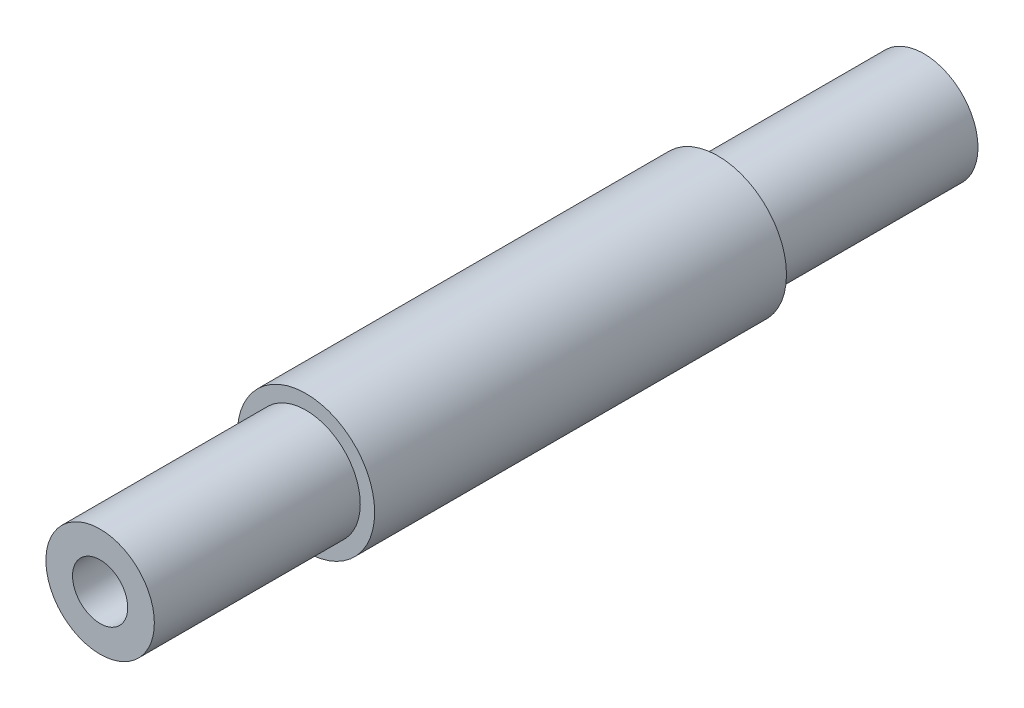
ISO-10303-21;
HEADER;
FILE_DESCRIPTION(('STEP AP214'),'2;1');
FILE_NAME('part.step','',(''),(''),'','','');
FILE_SCHEMA(('AUTOMOTIVE_DESIGN { 1 0 10303 214 1 1 1 1 }'));
ENDSEC;
DATA;
#1=APPLICATION_CONTEXT('core data for automotive mechanical design processes');
#2=APPLICATION_PROTOCOL_DEFINITION('international standard','automotive_design',2000,#1);
#3=PRODUCT_CONTEXT('',#1,'mechanical');
#4=PRODUCT('Part','Part','',(#3));
#5=PRODUCT_RELATED_PRODUCT_CATEGORY('part','',(#4));
#6=PRODUCT_DEFINITION_FORMATION('','',#4);
#7=PRODUCT_DEFINITION_CONTEXT('part definition',#1,'design');
#8=PRODUCT_DEFINITION('design','',#6,#7);
#9=PRODUCT_DEFINITION_SHAPE('','',#8);
#10=(LENGTH_UNIT() NAMED_UNIT(*) SI_UNIT(.MILLI.,.METRE.));
#11=(NAMED_UNIT(*) PLANE_ANGLE_UNIT() SI_UNIT($,.RADIAN.));
#12=(NAMED_UNIT(*) SI_UNIT($,.STERADIAN.) SOLID_ANGLE_UNIT());
#13=UNCERTAINTY_MEASURE_WITH_UNIT(LENGTH_MEASURE(1.E-05),#10,'distance_accuracy_value','');
#14=(GEOMETRIC_REPRESENTATION_CONTEXT(3) GLOBAL_UNCERTAINTY_ASSIGNED_CONTEXT((#13)) GLOBAL_UNIT_ASSIGNED_CONTEXT((#10,
#11,#12)) REPRESENTATION_CONTEXT('',''));
#15=CARTESIAN_POINT('',(0.,0.,0.));
#16=DIRECTION('',(0.,0.,1.));
#17=DIRECTION('',(1.,0.,0.));
#18=AXIS2_PLACEMENT_3D('',#15,#16,#17);
#19=CARTESIAN_POINT('',(0.,0.,19.05));
#20=DIRECTION('',(0.,0.,1.));
#21=DIRECTION('',(1.,0.,0.));
#22=AXIS2_PLACEMENT_3D('',#19,#20,#21);
#23=PLANE('',#22);
#24=CARTESIAN_POINT('',(0.,0.,19.05));
#25=DIRECTION('',(0.,0.,1.));
#26=DIRECTION('',(1.,0.,0.));
#27=AXIS2_PLACEMENT_3D('',#24,#25,#26);
#28=CIRCLE('',#27,6.35);
#29=CARTESIAN_POINT('',(6.35,0.,19.05));
#30=VERTEX_POINT('',#29);
#31=EDGE_CURVE('E11',#30,#30,#28,.T.);
#32=ORIENTED_EDGE('',*,*,#31,.T.);
#33=EDGE_LOOP('',(#32));
#34=FACE_BOUND('',#33,.T.);
#35=CARTESIAN_POINT('',(0.,0.,19.05));
#36=DIRECTION('',(0.,0.,1.));
#37=DIRECTION('',(1.,0.,0.));
#38=AXIS2_PLACEMENT_3D('',#35,#36,#37);
#39=CIRCLE('',#38,5.0165);
#40=CARTESIAN_POINT('',(5.0165,0.,19.05));
#41=VERTEX_POINT('',#40);
#42=EDGE_CURVE('E66',#41,#41,#39,.T.);
#43=ORIENTED_EDGE('',*,*,#42,.F.);
#44=EDGE_LOOP('',(#43));
#45=FACE_BOUND('',#44,.T.);
#46=ADVANCED_FACE('F53',(#34,#45),#23,.T.);
#47=CARTESIAN_POINT('',(0.,0.,-19.05));
#48=DIRECTION('',(0.,0.,1.));
#49=DIRECTION('',(1.,0.,0.));
#50=AXIS2_PLACEMENT_3D('',#47,#48,#49);
#51=PLANE('',#50);
#52=CARTESIAN_POINT('',(0.,0.,-19.05));
#53=DIRECTION('',(0.,0.,1.));
#54=DIRECTION('',(1.,0.,0.));
#55=AXIS2_PLACEMENT_3D('',#52,#53,#54);
#56=CIRCLE('',#55,6.35);
#57=CARTESIAN_POINT('',(6.35,0.,-19.05));
#58=VERTEX_POINT('',#57);
#59=EDGE_CURVE('E57',#58,#58,#56,.T.);
#60=ORIENTED_EDGE('',*,*,#59,.F.);
#61=EDGE_LOOP('',(#60));
#62=FACE_BOUND('',#61,.T.);
#63=CARTESIAN_POINT('',(0.,0.,-19.05));
#64=DIRECTION('',(0.,0.,1.));
#65=DIRECTION('',(1.,0.,0.));
#66=AXIS2_PLACEMENT_3D('',#63,#64,#65);
#67=CIRCLE('',#66,5.0165);
#68=CARTESIAN_POINT('',(5.0165,0.,-19.05));
#69=VERTEX_POINT('',#68);
#70=EDGE_CURVE('E71',#69,#69,#67,.F.);
#71=ORIENTED_EDGE('',*,*,#70,.F.);
#72=EDGE_LOOP('',(#71));
#73=FACE_BOUND('',#72,.T.);
#74=ADVANCED_FACE('F107',(#62,#73),#51,.F.);
#75=CARTESIAN_POINT('',(0.,0.,19.05));
#76=DIRECTION('',(0.,0.,-1.));
#77=DIRECTION('',(-1.,0.,0.));
#78=AXIS2_PLACEMENT_3D('',#75,#76,#77);
#79=CYLINDRICAL_SURFACE('',#78,6.35);
#80=ORIENTED_EDGE('',*,*,#31,.F.);
#81=EDGE_LOOP('',(#80));
#82=FACE_BOUND('',#81,.T.);
#83=ORIENTED_EDGE('',*,*,#59,.T.);
#84=EDGE_LOOP('',(#83));
#85=FACE_BOUND('',#84,.T.);
#86=ADVANCED_FACE('F55',(#82,#85),#79,.T.);
#87=CARTESIAN_POINT('',(0.,0.,-38.1));
#88=DIRECTION('',(0.,0.,1.));
#89=DIRECTION('',(1.,0.,0.));
#90=AXIS2_PLACEMENT_3D('',#87,#88,#89);
#91=PLANE('',#90);
#92=CARTESIAN_POINT('',(0.,0.,-38.1));
#93=DIRECTION('',(0.,0.,-1.));
#94=DIRECTION('',(0.,1.,0.));
#95=AXIS2_PLACEMENT_3D('',#92,#93,#94);
#96=CIRCLE('',#95,2.55269999999999);
#97=CARTESIAN_POINT('',(0.,2.55269999999999,-38.1));
#98=VERTEX_POINT('',#97);
#99=EDGE_CURVE('E87',#98,#98,#96,.T.);
#100=ORIENTED_EDGE('',*,*,#99,.F.);
#101=EDGE_LOOP('',(#100));
#102=FACE_BOUND('',#101,.T.);
#103=CARTESIAN_POINT('',(0.,0.,-38.1));
#104=DIRECTION('',(0.,0.,1.));
#105=DIRECTION('',(1.,0.,0.));
#106=AXIS2_PLACEMENT_3D('',#103,#104,#105);
#107=CIRCLE('',#106,5.0165);
#108=CARTESIAN_POINT('',(5.0165,0.,-38.1));
#109=VERTEX_POINT('',#108);
#110=EDGE_CURVE('E76',#109,#109,#107,.T.);
#111=ORIENTED_EDGE('',*,*,#110,.F.);
#112=EDGE_LOOP('',(#111));
#113=FACE_BOUND('',#112,.T.);
#114=ADVANCED_FACE('F94',(#102,#113),#91,.F.);
#115=CARTESIAN_POINT('',(0.,0.,38.1));
#116=DIRECTION('',(0.,0.,-1.));
#117=DIRECTION('',(-1.,0.,0.));
#118=AXIS2_PLACEMENT_3D('',#115,#116,#117);
#119=CYLINDRICAL_SURFACE('',#118,5.0165);
#120=ORIENTED_EDGE('',*,*,#110,.T.);
#121=EDGE_LOOP('',(#120));
#122=FACE_BOUND('',#121,.T.);
#123=ORIENTED_EDGE('',*,*,#70,.T.);
#124=EDGE_LOOP('',(#123));
#125=FACE_BOUND('',#124,.T.);
#126=ADVANCED_FACE('F97',(#122,#125),#119,.T.);
#127=ORIENTED_EDGE('',*,*,#42,.T.);
#128=EDGE_LOOP('',(#127));
#129=FACE_BOUND('',#128,.T.);
#130=CARTESIAN_POINT('',(0.,0.,38.1));
#131=DIRECTION('',(0.,0.,1.));
#132=DIRECTION('',(1.,0.,0.));
#133=AXIS2_PLACEMENT_3D('',#130,#131,#132);
#134=CIRCLE('',#133,5.0165);
#135=CARTESIAN_POINT('',(5.0165,0.,38.1));
#136=VERTEX_POINT('',#135);
#137=EDGE_CURVE('E75',#136,#136,#134,.T.);
#138=ORIENTED_EDGE('',*,*,#137,.F.);
#139=EDGE_LOOP('',(#138));
#140=FACE_BOUND('',#139,.T.);
#141=ADVANCED_FACE('F103',(#129,#140),#119,.T.);
#142=CARTESIAN_POINT('',(0.,0.,38.1));
#143=DIRECTION('',(0.,0.,1.));
#144=DIRECTION('',(1.,0.,0.));
#145=AXIS2_PLACEMENT_3D('',#142,#143,#144);
#146=PLANE('',#145);
#147=CARTESIAN_POINT('',(0.,0.,38.1));
#148=DIRECTION('',(0.,0.,-1.));
#149=DIRECTION('',(0.,1.,0.));
#150=AXIS2_PLACEMENT_3D('',#147,#148,#149);
#151=CIRCLE('',#150,2.55269999999998);
#152=CARTESIAN_POINT('',(0.,2.55269999999999,38.1));
#153=VERTEX_POINT('',#152);
#154=EDGE_CURVE('E80',#153,#153,#151,.T.);
#155=ORIENTED_EDGE('',*,*,#154,.T.);
#156=EDGE_LOOP('',(#155));
#157=FACE_BOUND('',#156,.T.);
#158=ORIENTED_EDGE('',*,*,#137,.T.);
#159=EDGE_LOOP('',(#158));
#160=FACE_BOUND('',#159,.T.);
#161=ADVANCED_FACE('F118',(#157,#160),#146,.T.);
#162=CARTESIAN_POINT('',(0.,0.,-38.1));
#163=DIRECTION('',(0.,0.,-1.));
#164=DIRECTION('',(0.,1.,0.));
#165=AXIS2_PLACEMENT_3D('',#162,#163,#164);
#166=CYLINDRICAL_SURFACE('',#165,2.55269999999999);
#167=ORIENTED_EDGE('',*,*,#154,.F.);
#168=EDGE_LOOP('',(#167));
#169=FACE_BOUND('',#168,.T.);
#170=ORIENTED_EDGE('',*,*,#99,.T.);
#171=EDGE_LOOP('',(#170));
#172=FACE_BOUND('',#171,.T.);
#173=ADVANCED_FACE('F92',(#169,#172),#166,.F.);
#174=CLOSED_SHELL('',(#46,#74,#86,#114,#126,#141,#161,#173));
#175=MANIFOLD_SOLID_BREP('B2',#174);
#176=ADVANCED_BREP_SHAPE_REPRESENTATION('',(#18,#175),#14);
#177=SHAPE_DEFINITION_REPRESENTATION(#9,#176);
ENDSEC;
END-ISO-10303-21;
